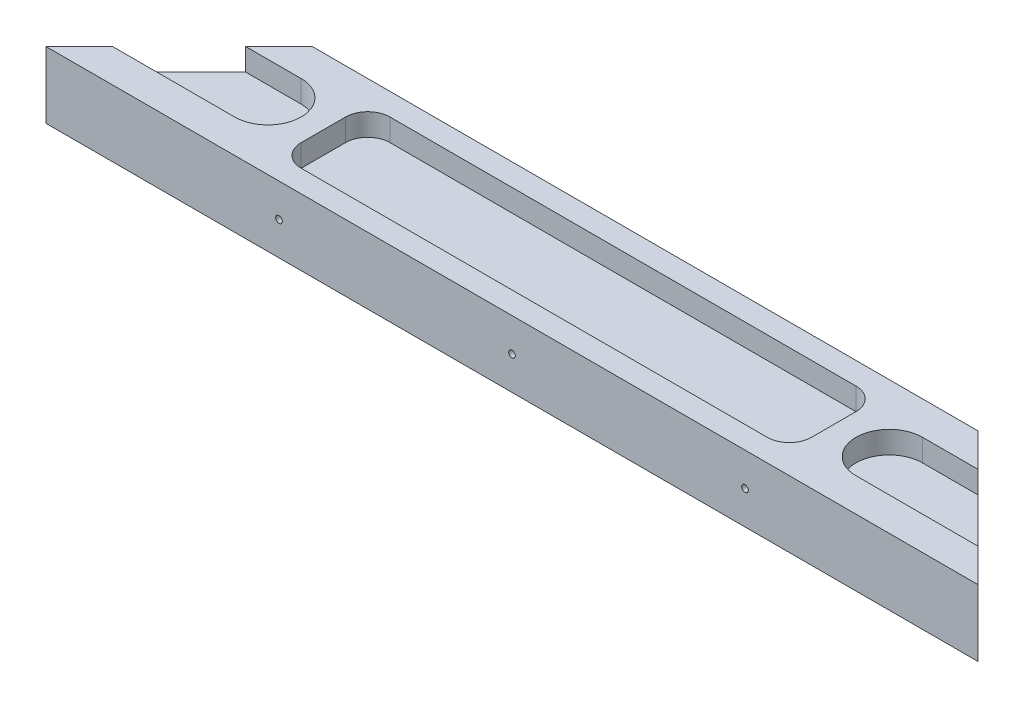
ISO-10303-21;
HEADER;
FILE_DESCRIPTION(('STEP AP214'),'2;1');
FILE_NAME('part.step','',(''),(''),'','','');
FILE_SCHEMA(('AUTOMOTIVE_DESIGN { 1 0 10303 214 1 1 1 1 }'));
ENDSEC;
DATA;
#1=APPLICATION_CONTEXT('core data for automotive mechanical design processes');
#2=APPLICATION_PROTOCOL_DEFINITION('international standard','automotive_design',2000,#1);
#3=PRODUCT_CONTEXT('',#1,'mechanical');
#4=PRODUCT('Part','Part','',(#3));
#5=PRODUCT_RELATED_PRODUCT_CATEGORY('part','',(#4));
#6=PRODUCT_DEFINITION_FORMATION('','',#4);
#7=PRODUCT_DEFINITION_CONTEXT('part definition',#1,'design');
#8=PRODUCT_DEFINITION('design','',#6,#7);
#9=PRODUCT_DEFINITION_SHAPE('','',#8);
#10=(LENGTH_UNIT() NAMED_UNIT(*) SI_UNIT(.MILLI.,.METRE.));
#11=(NAMED_UNIT(*) PLANE_ANGLE_UNIT() SI_UNIT($,.RADIAN.));
#12=(NAMED_UNIT(*) SI_UNIT($,.STERADIAN.) SOLID_ANGLE_UNIT());
#13=UNCERTAINTY_MEASURE_WITH_UNIT(LENGTH_MEASURE(1.E-05),#10,'distance_accuracy_value','');
#14=(GEOMETRIC_REPRESENTATION_CONTEXT(3) GLOBAL_UNCERTAINTY_ASSIGNED_CONTEXT((#13)) GLOBAL_UNIT_ASSIGNED_CONTEXT((#10,
#11,#12)) REPRESENTATION_CONTEXT('',''));
#15=CARTESIAN_POINT('',(0.,0.,0.));
#16=DIRECTION('',(0.,0.,1.));
#17=DIRECTION('',(1.,0.,0.));
#18=AXIS2_PLACEMENT_3D('',#15,#16,#17);
#19=CARTESIAN_POINT('',(30.,15.,-30.));
#20=DIRECTION('',(0.707106781186547,0.,0.707106781186548));
#21=DIRECTION('',(0.707106781186548,0.,-0.707106781186547));
#22=AXIS2_PLACEMENT_3D('',#19,#20,#21);
#23=PLANE('',#22);
#24=DIRECTION('',(-0.707106781186548,0.,0.707106781186547));
#25=VECTOR('',#24,1.);
#26=CARTESIAN_POINT('',(30.,10.,-30.));
#27=LINE('',#26,#25);
#28=CARTESIAN_POINT('',(22.5,10.,-22.5));
#29=VERTEX_POINT('',#28);
#30=CARTESIAN_POINT('',(7.5,10.,-7.49999999999999));
#31=VERTEX_POINT('',#30);
#32=EDGE_CURVE('E11',#29,#31,#27,.T.);
#33=ORIENTED_EDGE('',*,*,#32,.F.);
#34=DIRECTION('',(0.,1.,0.));
#35=VECTOR('',#34,1.);
#36=CARTESIAN_POINT('',(22.5,15.,-22.5));
#37=LINE('',#36,#35);
#38=CARTESIAN_POINT('',(22.5,15.,-22.5));
#39=VERTEX_POINT('',#38);
#40=EDGE_CURVE('E306',#29,#39,#37,.T.);
#41=ORIENTED_EDGE('',*,*,#40,.T.);
#42=DIRECTION('',(-0.707106781186548,0.,0.707106781186547));
#43=VECTOR('',#42,1.);
#44=CARTESIAN_POINT('',(30.,15.,-30.));
#45=LINE('',#44,#43);
#46=CARTESIAN_POINT('',(30.,15.,-30.));
#47=VERTEX_POINT('',#46);
#48=EDGE_CURVE('E310',#47,#39,#45,.T.);
#49=ORIENTED_EDGE('',*,*,#48,.F.);
#50=DIRECTION('',(0.,-1.,0.));
#51=VECTOR('',#50,1.);
#52=CARTESIAN_POINT('',(30.,15.,-30.));
#53=LINE('',#52,#51);
#54=CARTESIAN_POINT('',(30.,0.,-30.));
#55=VERTEX_POINT('',#54);
#56=EDGE_CURVE('E322',#47,#55,#53,.T.);
#57=ORIENTED_EDGE('',*,*,#56,.T.);
#58=DIRECTION('',(-0.707106781186548,0.,0.707106781186547));
#59=VECTOR('',#58,1.);
#60=CARTESIAN_POINT('',(30.,0.,-30.));
#61=LINE('',#60,#59);
#62=CARTESIAN_POINT('',(0.,0.,0.));
#63=VERTEX_POINT('',#62);
#64=EDGE_CURVE('E309',#55,#63,#61,.T.);
#65=ORIENTED_EDGE('',*,*,#64,.T.);
#66=DIRECTION('',(0.,-1.,0.));
#67=VECTOR('',#66,1.);
#68=CARTESIAN_POINT('',(0.,15.,0.));
#69=LINE('',#68,#67);
#70=CARTESIAN_POINT('',(0.,15.,0.));
#71=VERTEX_POINT('',#70);
#72=EDGE_CURVE('E339',#71,#63,#69,.T.);
#73=ORIENTED_EDGE('',*,*,#72,.F.);
#74=CARTESIAN_POINT('',(7.5,15.,-7.5));
#75=VERTEX_POINT('',#74);
#76=EDGE_CURVE('E314',#75,#71,#45,.T.);
#77=ORIENTED_EDGE('',*,*,#76,.F.);
#78=DIRECTION('',(0.,-1.,0.));
#79=VECTOR('',#78,1.);
#80=CARTESIAN_POINT('',(7.5,15.,-7.5));
#81=LINE('',#80,#79);
#82=EDGE_CURVE('E303',#75,#31,#81,.T.);
#83=ORIENTED_EDGE('',*,*,#82,.T.);
#84=EDGE_LOOP('',(#33,#41,#49,#57,#65,#73,#77,#83));
#85=FACE_BOUND('',#84,.T.);
#86=ADVANCED_FACE('F39',(#85),#23,.F.);
#87=CARTESIAN_POINT('',(0.,15.,0.));
#88=DIRECTION('',(0.,0.,-1.));
#89=DIRECTION('',(-1.,0.,0.));
#90=AXIS2_PLACEMENT_3D('',#87,#88,#89);
#91=PLANE('',#90);
#92=CARTESIAN_POINT('',(157.5,7.5,0.));
#93=DIRECTION('',(0.,0.,1.));
#94=DIRECTION('',(1.,0.,0.));
#95=AXIS2_PLACEMENT_3D('',#92,#93,#94);
#96=CIRCLE('',#95,0.750000000000012);
#97=CARTESIAN_POINT('',(158.25,7.5,0.));
#98=VERTEX_POINT('',#97);
#99=EDGE_CURVE('E250',#98,#98,#96,.T.);
#100=ORIENTED_EDGE('',*,*,#99,.F.);
#101=EDGE_LOOP('',(#100));
#102=FACE_BOUND('',#101,.T.);
#103=CARTESIAN_POINT('',(52.5,7.5,0.));
#104=DIRECTION('',(0.,0.,1.));
#105=DIRECTION('',(1.,0.,0.));
#106=AXIS2_PLACEMENT_3D('',#103,#104,#105);
#107=CIRCLE('',#106,0.749999999999999);
#108=CARTESIAN_POINT('',(53.25,7.5,0.));
#109=VERTEX_POINT('',#108);
#110=EDGE_CURVE('E249',#109,#109,#107,.T.);
#111=ORIENTED_EDGE('',*,*,#110,.F.);
#112=EDGE_LOOP('',(#111));
#113=FACE_BOUND('',#112,.T.);
#114=CARTESIAN_POINT('',(105.,7.5,0.));
#115=DIRECTION('',(0.,0.,1.));
#116=DIRECTION('',(1.,0.,0.));
#117=AXIS2_PLACEMENT_3D('',#114,#115,#116);
#118=CIRCLE('',#117,0.749999999999999);
#119=CARTESIAN_POINT('',(105.75,7.5,0.));
#120=VERTEX_POINT('',#119);
#121=EDGE_CURVE('E253',#120,#120,#118,.T.);
#122=ORIENTED_EDGE('',*,*,#121,.F.);
#123=EDGE_LOOP('',(#122));
#124=FACE_BOUND('',#123,.T.);
#125=DIRECTION('',(1.,0.,0.));
#126=VECTOR('',#125,1.);
#127=CARTESIAN_POINT('',(0.,0.,0.));
#128=LINE('',#127,#126);
#129=CARTESIAN_POINT('',(210.,0.,0.));
#130=VERTEX_POINT('',#129);
#131=EDGE_CURVE('E325',#63,#130,#128,.T.);
#132=ORIENTED_EDGE('',*,*,#131,.T.);
#133=DIRECTION('',(0.,-1.,0.));
#134=VECTOR('',#133,1.);
#135=CARTESIAN_POINT('',(210.,15.,0.));
#136=LINE('',#135,#134);
#137=CARTESIAN_POINT('',(210.,15.,0.));
#138=VERTEX_POINT('',#137);
#139=EDGE_CURVE('E336',#138,#130,#136,.T.);
#140=ORIENTED_EDGE('',*,*,#139,.F.);
#141=DIRECTION('',(1.,0.,0.));
#142=VECTOR('',#141,1.);
#143=CARTESIAN_POINT('',(0.,15.,0.));
#144=LINE('',#143,#142);
#145=EDGE_CURVE('E313',#71,#138,#144,.T.);
#146=ORIENTED_EDGE('',*,*,#145,.F.);
#147=ORIENTED_EDGE('',*,*,#72,.T.);
#148=EDGE_LOOP('',(#132,#140,#146,#147));
#149=FACE_BOUND('',#148,.T.);
#150=ADVANCED_FACE('F395',(#102,#113,#124,#149),#91,.F.);
#151=CARTESIAN_POINT('',(210.,15.,0.));
#152=DIRECTION('',(-0.707106781186547,0.,0.707106781186548));
#153=DIRECTION('',(0.707106781186548,0.,0.707106781186547));
#154=AXIS2_PLACEMENT_3D('',#151,#152,#153);
#155=PLANE('',#154);
#156=DIRECTION('',(0.707106781186548,0.,0.707106781186547));
#157=VECTOR('',#156,1.);
#158=CARTESIAN_POINT('',(210.,10.,0.));
#159=LINE('',#158,#157);
#160=CARTESIAN_POINT('',(187.5,10.,-22.5));
#161=VERTEX_POINT('',#160);
#162=CARTESIAN_POINT('',(202.5,10.,-7.5));
#163=VERTEX_POINT('',#162);
#164=EDGE_CURVE('E46',#161,#163,#159,.T.);
#165=ORIENTED_EDGE('',*,*,#164,.T.);
#166=DIRECTION('',(0.,1.,0.));
#167=VECTOR('',#166,1.);
#168=CARTESIAN_POINT('',(202.5,15.,-7.49999999999999));
#169=LINE('',#168,#167);
#170=CARTESIAN_POINT('',(202.5,15.,-7.5));
#171=VERTEX_POINT('',#170);
#172=EDGE_CURVE('E300',#163,#171,#169,.T.);
#173=ORIENTED_EDGE('',*,*,#172,.T.);
#174=DIRECTION('',(-0.707106781186548,0.,-0.707106781186547));
#175=VECTOR('',#174,1.);
#176=CARTESIAN_POINT('',(210.,15.,0.));
#177=LINE('',#176,#175);
#178=EDGE_CURVE('E317',#138,#171,#177,.T.);
#179=ORIENTED_EDGE('',*,*,#178,.F.);
#180=ORIENTED_EDGE('',*,*,#139,.T.);
#181=DIRECTION('',(-0.707106781186548,0.,-0.707106781186547));
#182=VECTOR('',#181,1.);
#183=CARTESIAN_POINT('',(210.,0.,0.));
#184=LINE('',#183,#182);
#185=CARTESIAN_POINT('',(180.,0.,-30.));
#186=VERTEX_POINT('',#185);
#187=EDGE_CURVE('E327',#130,#186,#184,.T.);
#188=ORIENTED_EDGE('',*,*,#187,.T.);
#189=DIRECTION('',(0.,-1.,0.));
#190=VECTOR('',#189,1.);
#191=CARTESIAN_POINT('',(180.,15.,-30.));
#192=LINE('',#191,#190);
#193=CARTESIAN_POINT('',(180.,15.,-30.));
#194=VERTEX_POINT('',#193);
#195=EDGE_CURVE('E333',#194,#186,#192,.T.);
#196=ORIENTED_EDGE('',*,*,#195,.F.);
#197=CARTESIAN_POINT('',(187.5,15.,-22.5));
#198=VERTEX_POINT('',#197);
#199=EDGE_CURVE('E316',#198,#194,#177,.T.);
#200=ORIENTED_EDGE('',*,*,#199,.F.);
#201=DIRECTION('',(0.,-1.,0.));
#202=VECTOR('',#201,1.);
#203=CARTESIAN_POINT('',(187.5,15.,-22.5));
#204=LINE('',#203,#202);
#205=EDGE_CURVE('E61',#198,#161,#204,.T.);
#206=ORIENTED_EDGE('',*,*,#205,.T.);
#207=EDGE_LOOP('',(#165,#173,#179,#180,#188,#196,#200,#206));
#208=FACE_BOUND('',#207,.T.);
#209=ADVANCED_FACE('F348',(#208),#155,.F.);
#210=CARTESIAN_POINT('',(180.,15.,-30.));
#211=DIRECTION('',(0.,0.,1.));
#212=DIRECTION('',(1.,0.,0.));
#213=AXIS2_PLACEMENT_3D('',#210,#211,#212);
#214=PLANE('',#213);
#215=CARTESIAN_POINT('',(157.5,7.5,-30.));
#216=DIRECTION('',(0.,0.,1.));
#217=DIRECTION('',(1.,0.,0.));
#218=AXIS2_PLACEMENT_3D('',#215,#216,#217);
#219=CIRCLE('',#218,0.750000000000012);
#220=CARTESIAN_POINT('',(158.25,7.5,-30.));
#221=VERTEX_POINT('',#220);
#222=EDGE_CURVE('E234',#221,#221,#219,.F.);
#223=ORIENTED_EDGE('',*,*,#222,.F.);
#224=EDGE_LOOP('',(#223));
#225=FACE_BOUND('',#224,.T.);
#226=CARTESIAN_POINT('',(52.5,7.5,-30.));
#227=DIRECTION('',(0.,0.,1.));
#228=DIRECTION('',(1.,0.,0.));
#229=AXIS2_PLACEMENT_3D('',#226,#227,#228);
#230=CIRCLE('',#229,0.749999999999999);
#231=CARTESIAN_POINT('',(53.25,7.5,-30.));
#232=VERTEX_POINT('',#231);
#233=EDGE_CURVE('E246',#232,#232,#230,.F.);
#234=ORIENTED_EDGE('',*,*,#233,.F.);
#235=EDGE_LOOP('',(#234));
#236=FACE_BOUND('',#235,.T.);
#237=CARTESIAN_POINT('',(105.,7.5,-30.));
#238=DIRECTION('',(0.,0.,1.));
#239=DIRECTION('',(1.,0.,0.));
#240=AXIS2_PLACEMENT_3D('',#237,#238,#239);
#241=CIRCLE('',#240,0.749999999999999);
#242=CARTESIAN_POINT('',(105.75,7.5,-30.));
#243=VERTEX_POINT('',#242);
#244=EDGE_CURVE('E260',#243,#243,#241,.F.);
#245=ORIENTED_EDGE('',*,*,#244,.F.);
#246=EDGE_LOOP('',(#245));
#247=FACE_BOUND('',#246,.T.);
#248=DIRECTION('',(-1.,0.,0.));
#249=VECTOR('',#248,1.);
#250=CARTESIAN_POINT('',(180.,0.,-30.));
#251=LINE('',#250,#249);
#252=EDGE_CURVE('E329',#186,#55,#251,.T.);
#253=ORIENTED_EDGE('',*,*,#252,.T.);
#254=ORIENTED_EDGE('',*,*,#56,.F.);
#255=DIRECTION('',(-1.,0.,0.));
#256=VECTOR('',#255,1.);
#257=CARTESIAN_POINT('',(180.,15.,-30.));
#258=LINE('',#257,#256);
#259=EDGE_CURVE('E320',#194,#47,#258,.T.);
#260=ORIENTED_EDGE('',*,*,#259,.F.);
#261=ORIENTED_EDGE('',*,*,#195,.T.);
#262=EDGE_LOOP('',(#253,#254,#260,#261));
#263=FACE_BOUND('',#262,.T.);
#264=ADVANCED_FACE('F376',(#225,#236,#247,#263),#214,.F.);
#265=CARTESIAN_POINT('',(0.,15.,0.));
#266=DIRECTION('',(0.,-1.,0.));
#267=DIRECTION('',(0.,0.,-1.));
#268=AXIS2_PLACEMENT_3D('',#265,#266,#267);
#269=PLANE('',#268);
#270=DIRECTION('',(-1.,0.,0.));
#271=VECTOR('',#270,1.);
#272=CARTESIAN_POINT('',(52.5,15.,-25.));
#273=LINE('',#272,#271);
#274=CARTESIAN_POINT('',(157.5,15.,-25.));
#275=VERTEX_POINT('',#274);
#276=CARTESIAN_POINT('',(52.5,15.,-25.));
#277=VERTEX_POINT('',#276);
#278=EDGE_CURVE('E216',#275,#277,#273,.T.);
#279=ORIENTED_EDGE('',*,*,#278,.F.);
#280=CARTESIAN_POINT('',(157.5,15.,-20.));
#281=DIRECTION('',(0.,1.,0.));
#282=DIRECTION('',(0.,0.,-1.));
#283=AXIS2_PLACEMENT_3D('',#280,#281,#282);
#284=CIRCLE('',#283,5.);
#285=CARTESIAN_POINT('',(162.5,15.,-19.9999999999999));
#286=VERTEX_POINT('',#285);
#287=EDGE_CURVE('E53',#286,#275,#284,.T.);
#288=ORIENTED_EDGE('',*,*,#287,.F.);
#289=DIRECTION('',(0.,0.,-1.));
#290=VECTOR('',#289,1.);
#291=CARTESIAN_POINT('',(162.5,15.,-19.9999999999999));
#292=LINE('',#291,#290);
#293=CARTESIAN_POINT('',(162.5,15.,-10.));
#294=VERTEX_POINT('',#293);
#295=EDGE_CURVE('E196',#294,#286,#292,.T.);
#296=ORIENTED_EDGE('',*,*,#295,.F.);
#297=CARTESIAN_POINT('',(157.5,15.,-10.));
#298=DIRECTION('',(0.,1.,0.));
#299=DIRECTION('',(0.,0.,1.));
#300=AXIS2_PLACEMENT_3D('',#297,#298,#299);
#301=CIRCLE('',#300,5.);
#302=CARTESIAN_POINT('',(157.5,15.,-5.));
#303=VERTEX_POINT('',#302);
#304=EDGE_CURVE('E199',#303,#294,#301,.T.);
#305=ORIENTED_EDGE('',*,*,#304,.F.);
#306=DIRECTION('',(1.,0.,0.));
#307=VECTOR('',#306,1.);
#308=CARTESIAN_POINT('',(52.5,15.,-5.));
#309=LINE('',#308,#307);
#310=CARTESIAN_POINT('',(52.5,15.,-5.));
#311=VERTEX_POINT('',#310);
#312=EDGE_CURVE('E227',#311,#303,#309,.T.);
#313=ORIENTED_EDGE('',*,*,#312,.F.);
#314=CARTESIAN_POINT('',(52.5,15.,-10.));
#315=DIRECTION('',(0.,1.,0.));
#316=DIRECTION('',(0.,0.,1.));
#317=AXIS2_PLACEMENT_3D('',#314,#315,#316);
#318=CIRCLE('',#317,5.);
#319=CARTESIAN_POINT('',(47.5,15.,-10.));
#320=VERTEX_POINT('',#319);
#321=EDGE_CURVE('E224',#320,#311,#318,.T.);
#322=ORIENTED_EDGE('',*,*,#321,.F.);
#323=DIRECTION('',(0.,0.,1.));
#324=VECTOR('',#323,1.);
#325=CARTESIAN_POINT('',(47.5,15.,-19.9999999999999));
#326=LINE('',#325,#324);
#327=CARTESIAN_POINT('',(47.5,15.,-19.9999999999999));
#328=VERTEX_POINT('',#327);
#329=EDGE_CURVE('E221',#328,#320,#326,.T.);
#330=ORIENTED_EDGE('',*,*,#329,.F.);
#331=CARTESIAN_POINT('',(52.5,15.,-20.));
#332=DIRECTION('',(0.,1.,0.));
#333=DIRECTION('',(0.,0.,1.));
#334=AXIS2_PLACEMENT_3D('',#331,#332,#333);
#335=CIRCLE('',#334,5.);
#336=EDGE_CURVE('E218',#277,#328,#335,.T.);
#337=ORIENTED_EDGE('',*,*,#336,.F.);
#338=EDGE_LOOP('',(#279,#288,#296,#305,#313,#322,#330,#337));
#339=FACE_BOUND('',#338,.T.);
#340=ORIENTED_EDGE('',*,*,#48,.T.);
#341=DIRECTION('',(-1.,0.,0.));
#342=VECTOR('',#341,1.);
#343=CARTESIAN_POINT('',(-5.,15.,-22.5));
#344=LINE('',#343,#342);
#345=CARTESIAN_POINT('',(35.,15.,-22.5));
#346=VERTEX_POINT('',#345);
#347=EDGE_CURVE('E267',#346,#39,#344,.T.);
#348=ORIENTED_EDGE('',*,*,#347,.F.);
#349=CARTESIAN_POINT('',(35.,15.,-15.));
#350=DIRECTION('',(0.,1.,0.));
#351=DIRECTION('',(0.,0.,1.));
#352=AXIS2_PLACEMENT_3D('',#349,#350,#351);
#353=CIRCLE('',#352,7.5);
#354=CARTESIAN_POINT('',(35.,15.,-7.5));
#355=VERTEX_POINT('',#354);
#356=EDGE_CURVE('E274',#355,#346,#353,.T.);
#357=ORIENTED_EDGE('',*,*,#356,.F.);
#358=DIRECTION('',(-1.,0.,0.));
#359=VECTOR('',#358,1.);
#360=CARTESIAN_POINT('',(0.,15.,-7.49999999999999));
#361=LINE('',#360,#359);
#362=EDGE_CURVE('E344',#355,#75,#361,.T.);
#363=ORIENTED_EDGE('',*,*,#362,.T.);
#364=ORIENTED_EDGE('',*,*,#76,.T.);
#365=ORIENTED_EDGE('',*,*,#145,.T.);
#366=ORIENTED_EDGE('',*,*,#178,.T.);
#367=DIRECTION('',(1.,0.,0.));
#368=VECTOR('',#367,1.);
#369=CARTESIAN_POINT('',(215.,15.,-7.49999999999999));
#370=LINE('',#369,#368);
#371=CARTESIAN_POINT('',(175.,15.,-7.5));
#372=VERTEX_POINT('',#371);
#373=EDGE_CURVE('E288',#372,#171,#370,.T.);
#374=ORIENTED_EDGE('',*,*,#373,.F.);
#375=CARTESIAN_POINT('',(175.,15.,-15.));
#376=DIRECTION('',(0.,1.,0.));
#377=DIRECTION('',(0.,0.,-1.));
#378=AXIS2_PLACEMENT_3D('',#375,#376,#377);
#379=CIRCLE('',#378,7.5);
#380=CARTESIAN_POINT('',(175.,15.,-22.5));
#381=VERTEX_POINT('',#380);
#382=EDGE_CURVE('E277',#381,#372,#379,.T.);
#383=ORIENTED_EDGE('',*,*,#382,.F.);
#384=DIRECTION('',(1.,0.,0.));
#385=VECTOR('',#384,1.);
#386=CARTESIAN_POINT('',(0.,15.,-22.5));
#387=LINE('',#386,#385);
#388=EDGE_CURVE('E342',#381,#198,#387,.T.);
#389=ORIENTED_EDGE('',*,*,#388,.T.);
#390=ORIENTED_EDGE('',*,*,#199,.T.);
#391=ORIENTED_EDGE('',*,*,#259,.T.);
#392=EDGE_LOOP('',(#340,#348,#357,#363,#364,#365,#366,#374,#383,#389,#390,#391));
#393=FACE_BOUND('',#392,.T.);
#394=ADVANCED_FACE('F364',(#339,#393),#269,.F.);
#395=CARTESIAN_POINT('',(0.,0.,0.));
#396=DIRECTION('',(0.,-1.,0.));
#397=DIRECTION('',(0.,0.,-1.));
#398=AXIS2_PLACEMENT_3D('',#395,#396,#397);
#399=PLANE('',#398);
#400=ORIENTED_EDGE('',*,*,#64,.F.);
#401=ORIENTED_EDGE('',*,*,#252,.F.);
#402=ORIENTED_EDGE('',*,*,#187,.F.);
#403=ORIENTED_EDGE('',*,*,#131,.F.);
#404=EDGE_LOOP('',(#400,#401,#402,#403));
#405=FACE_BOUND('',#404,.T.);
#406=ADVANCED_FACE('F373',(#405),#399,.T.);
#407=CARTESIAN_POINT('',(215.,10.,-15.));
#408=DIRECTION('',(0.,-1.,0.));
#409=DIRECTION('',(0.,0.,-1.));
#410=AXIS2_PLACEMENT_3D('',#407,#408,#409);
#411=PLANE('',#410);
#412=DIRECTION('',(-1.,0.,0.));
#413=VECTOR('',#412,1.);
#414=CARTESIAN_POINT('',(215.,10.,-22.5));
#415=LINE('',#414,#413);
#416=CARTESIAN_POINT('',(175.,10.,-22.5));
#417=VERTEX_POINT('',#416);
#418=EDGE_CURVE('E290',#161,#417,#415,.T.);
#419=ORIENTED_EDGE('',*,*,#418,.T.);
#420=CARTESIAN_POINT('',(175.,10.,-15.));
#421=DIRECTION('',(0.,1.,0.));
#422=DIRECTION('',(0.,0.,-1.));
#423=AXIS2_PLACEMENT_3D('',#420,#421,#422);
#424=CIRCLE('',#423,7.5);
#425=CARTESIAN_POINT('',(175.,10.,-7.5));
#426=VERTEX_POINT('',#425);
#427=EDGE_CURVE('E295',#417,#426,#424,.T.);
#428=ORIENTED_EDGE('',*,*,#427,.T.);
#429=DIRECTION('',(1.,0.,0.));
#430=VECTOR('',#429,1.);
#431=CARTESIAN_POINT('',(215.,10.,-7.49999999999999));
#432=LINE('',#431,#430);
#433=EDGE_CURVE('E286',#426,#163,#432,.T.);
#434=ORIENTED_EDGE('',*,*,#433,.T.);
#435=ORIENTED_EDGE('',*,*,#164,.F.);
#436=EDGE_LOOP('',(#419,#428,#434,#435));
#437=FACE_BOUND('',#436,.T.);
#438=ADVANCED_FACE('F352',(#437),#411,.F.);
#439=CARTESIAN_POINT('',(215.,10.,-7.49999999999999));
#440=DIRECTION('',(0.,0.,1.));
#441=DIRECTION('',(1.,0.,0.));
#442=AXIS2_PLACEMENT_3D('',#439,#440,#441);
#443=PLANE('',#442);
#444=ORIENTED_EDGE('',*,*,#433,.F.);
#445=DIRECTION('',(0.,1.,0.));
#446=VECTOR('',#445,1.);
#447=CARTESIAN_POINT('',(175.,10.,-7.5));
#448=LINE('',#447,#446);
#449=EDGE_CURVE('E263',#426,#372,#448,.T.);
#450=ORIENTED_EDGE('',*,*,#449,.T.);
#451=ORIENTED_EDGE('',*,*,#373,.T.);
#452=ORIENTED_EDGE('',*,*,#172,.F.);
#453=EDGE_LOOP('',(#444,#450,#451,#452));
#454=FACE_BOUND('',#453,.T.);
#455=ADVANCED_FACE('F361',(#454),#443,.F.);
#456=CARTESIAN_POINT('',(215.,10.,-22.5));
#457=DIRECTION('',(0.,0.,-1.));
#458=DIRECTION('',(-1.,0.,0.));
#459=AXIS2_PLACEMENT_3D('',#456,#457,#458);
#460=PLANE('',#459);
#461=ORIENTED_EDGE('',*,*,#388,.F.);
#462=DIRECTION('',(0.,1.,0.));
#463=VECTOR('',#462,1.);
#464=CARTESIAN_POINT('',(175.,10.,-22.5));
#465=LINE('',#464,#463);
#466=EDGE_CURVE('E283',#417,#381,#465,.T.);
#467=ORIENTED_EDGE('',*,*,#466,.F.);
#468=ORIENTED_EDGE('',*,*,#418,.F.);
#469=ORIENTED_EDGE('',*,*,#205,.F.);
#470=EDGE_LOOP('',(#461,#467,#468,#469));
#471=FACE_BOUND('',#470,.T.);
#472=ADVANCED_FACE('F355',(#471),#460,.F.);
#473=CARTESIAN_POINT('',(175.,10.,-15.));
#474=DIRECTION('',(0.,1.,0.));
#475=DIRECTION('',(0.,0.,1.));
#476=AXIS2_PLACEMENT_3D('',#473,#474,#475);
#477=CYLINDRICAL_SURFACE('',#476,7.5);
#478=ORIENTED_EDGE('',*,*,#382,.T.);
#479=ORIENTED_EDGE('',*,*,#449,.F.);
#480=ORIENTED_EDGE('',*,*,#427,.F.);
#481=ORIENTED_EDGE('',*,*,#466,.T.);
#482=EDGE_LOOP('',(#478,#479,#480,#481));
#483=FACE_BOUND('',#482,.T.);
#484=ADVANCED_FACE('F359',(#483),#477,.F.);
#485=CARTESIAN_POINT('',(-5.,10.,-15.));
#486=DIRECTION('',(0.,1.,0.));
#487=DIRECTION('',(0.,0.,1.));
#488=AXIS2_PLACEMENT_3D('',#485,#486,#487);
#489=PLANE('',#488);
#490=ORIENTED_EDGE('',*,*,#32,.T.);
#491=DIRECTION('',(1.,0.,0.));
#492=VECTOR('',#491,1.);
#493=CARTESIAN_POINT('',(-5.,10.,-7.49999999999999));
#494=LINE('',#493,#492);
#495=CARTESIAN_POINT('',(35.,10.,-7.5));
#496=VERTEX_POINT('',#495);
#497=EDGE_CURVE('E264',#31,#496,#494,.T.);
#498=ORIENTED_EDGE('',*,*,#497,.T.);
#499=CARTESIAN_POINT('',(35.,10.,-15.));
#500=DIRECTION('',(0.,1.,0.));
#501=DIRECTION('',(0.,0.,1.));
#502=AXIS2_PLACEMENT_3D('',#499,#500,#501);
#503=CIRCLE('',#502,7.5);
#504=CARTESIAN_POINT('',(35.,10.,-22.5));
#505=VERTEX_POINT('',#504);
#506=EDGE_CURVE('E266',#496,#505,#503,.T.);
#507=ORIENTED_EDGE('',*,*,#506,.T.);
#508=DIRECTION('',(-1.,0.,0.));
#509=VECTOR('',#508,1.);
#510=CARTESIAN_POINT('',(-5.,10.,-22.5));
#511=LINE('',#510,#509);
#512=EDGE_CURVE('E270',#505,#29,#511,.T.);
#513=ORIENTED_EDGE('',*,*,#512,.T.);
#514=EDGE_LOOP('',(#490,#498,#507,#513));
#515=FACE_BOUND('',#514,.T.);
#516=ADVANCED_FACE('F421',(#515),#489,.T.);
#517=CARTESIAN_POINT('',(-5.,10.,-22.5));
#518=DIRECTION('',(0.,0.,-1.));
#519=DIRECTION('',(-1.,0.,0.));
#520=AXIS2_PLACEMENT_3D('',#517,#518,#519);
#521=PLANE('',#520);
#522=ORIENTED_EDGE('',*,*,#512,.F.);
#523=DIRECTION('',(0.,1.,0.));
#524=VECTOR('',#523,1.);
#525=CARTESIAN_POINT('',(35.,10.,-22.5));
#526=LINE('',#525,#524);
#527=EDGE_CURVE('E279',#505,#346,#526,.T.);
#528=ORIENTED_EDGE('',*,*,#527,.T.);
#529=ORIENTED_EDGE('',*,*,#347,.T.);
#530=ORIENTED_EDGE('',*,*,#40,.F.);
#531=EDGE_LOOP('',(#522,#528,#529,#530));
#532=FACE_BOUND('',#531,.T.);
#533=ADVANCED_FACE('F386',(#532),#521,.F.);
#534=CARTESIAN_POINT('',(-5.,10.,-7.49999999999999));
#535=DIRECTION('',(0.,0.,1.));
#536=DIRECTION('',(1.,0.,0.));
#537=AXIS2_PLACEMENT_3D('',#534,#535,#536);
#538=PLANE('',#537);
#539=ORIENTED_EDGE('',*,*,#362,.F.);
#540=DIRECTION('',(0.,1.,0.));
#541=VECTOR('',#540,1.);
#542=CARTESIAN_POINT('',(35.,10.,-7.5));
#543=LINE('',#542,#541);
#544=EDGE_CURVE('E273',#496,#355,#543,.T.);
#545=ORIENTED_EDGE('',*,*,#544,.F.);
#546=ORIENTED_EDGE('',*,*,#497,.F.);
#547=ORIENTED_EDGE('',*,*,#82,.F.);
#548=EDGE_LOOP('',(#539,#545,#546,#547));
#549=FACE_BOUND('',#548,.T.);
#550=ADVANCED_FACE('F393',(#549),#538,.F.);
#551=CARTESIAN_POINT('',(35.,10.,-15.));
#552=DIRECTION('',(0.,1.,0.));
#553=DIRECTION('',(0.,0.,1.));
#554=AXIS2_PLACEMENT_3D('',#551,#552,#553);
#555=CYLINDRICAL_SURFACE('',#554,7.5);
#556=ORIENTED_EDGE('',*,*,#356,.T.);
#557=ORIENTED_EDGE('',*,*,#527,.F.);
#558=ORIENTED_EDGE('',*,*,#506,.F.);
#559=ORIENTED_EDGE('',*,*,#544,.T.);
#560=EDGE_LOOP('',(#556,#557,#558,#559));
#561=FACE_BOUND('',#560,.T.);
#562=ADVANCED_FACE('F389',(#561),#555,.F.);
#563=CARTESIAN_POINT('',(105.,7.5,-32.1213203435596));
#564=DIRECTION('',(0.,0.,1.));
#565=DIRECTION('',(1.,0.,0.));
#566=AXIS2_PLACEMENT_3D('',#563,#564,#565);
#567=CYLINDRICAL_SURFACE('',#566,0.749999999999999);
#568=ORIENTED_EDGE('',*,*,#244,.T.);
#569=EDGE_LOOP('',(#568));
#570=FACE_BOUND('',#569,.T.);
#571=ORIENTED_EDGE('',*,*,#121,.T.);
#572=EDGE_LOOP('',(#571));
#573=FACE_BOUND('',#572,.T.);
#574=ADVANCED_FACE('F427',(#570,#573),#567,.F.);
#575=CARTESIAN_POINT('',(52.5,7.5,-32.1213203435596));
#576=DIRECTION('',(0.,0.,1.));
#577=DIRECTION('',(1.,0.,0.));
#578=AXIS2_PLACEMENT_3D('',#575,#576,#577);
#579=CYLINDRICAL_SURFACE('',#578,0.749999999999999);
#580=ORIENTED_EDGE('',*,*,#233,.T.);
#581=EDGE_LOOP('',(#580));
#582=FACE_BOUND('',#581,.T.);
#583=ORIENTED_EDGE('',*,*,#110,.T.);
#584=EDGE_LOOP('',(#583));
#585=FACE_BOUND('',#584,.T.);
#586=ADVANCED_FACE('F435',(#582,#585),#579,.F.);
#587=CARTESIAN_POINT('',(157.5,7.5,-32.1213203435596));
#588=DIRECTION('',(0.,0.,1.));
#589=DIRECTION('',(1.,0.,0.));
#590=AXIS2_PLACEMENT_3D('',#587,#588,#589);
#591=CYLINDRICAL_SURFACE('',#590,0.750000000000012);
#592=ORIENTED_EDGE('',*,*,#222,.T.);
#593=EDGE_LOOP('',(#592));
#594=FACE_BOUND('',#593,.T.);
#595=ORIENTED_EDGE('',*,*,#99,.T.);
#596=EDGE_LOOP('',(#595));
#597=FACE_BOUND('',#596,.T.);
#598=ADVANCED_FACE('F437',(#594,#597),#591,.F.);
#599=CARTESIAN_POINT('',(157.5,10.,-20.));
#600=DIRECTION('',(0.,1.,0.));
#601=DIRECTION('',(0.,0.,1.));
#602=AXIS2_PLACEMENT_3D('',#599,#600,#601);
#603=CYLINDRICAL_SURFACE('',#602,5.);
#604=ORIENTED_EDGE('',*,*,#287,.T.);
#605=DIRECTION('',(0.,1.,0.));
#606=VECTOR('',#605,1.);
#607=CARTESIAN_POINT('',(157.5,10.,-25.));
#608=LINE('',#607,#606);
#609=CARTESIAN_POINT('',(157.5,10.,-25.));
#610=VERTEX_POINT('',#609);
#611=EDGE_CURVE('E173',#610,#275,#608,.T.);
#612=ORIENTED_EDGE('',*,*,#611,.F.);
#613=CARTESIAN_POINT('',(157.5,10.,-20.));
#614=DIRECTION('',(0.,1.,0.));
#615=DIRECTION('',(0.,0.,-1.));
#616=AXIS2_PLACEMENT_3D('',#613,#614,#615);
#617=CIRCLE('',#616,5.);
#618=CARTESIAN_POINT('',(162.5,10.,-19.9999999999999));
#619=VERTEX_POINT('',#618);
#620=EDGE_CURVE('E177',#619,#610,#617,.T.);
#621=ORIENTED_EDGE('',*,*,#620,.F.);
#622=DIRECTION('',(0.,1.,0.));
#623=VECTOR('',#622,1.);
#624=CARTESIAN_POINT('',(162.5,10.,-19.9999999999999));
#625=LINE('',#624,#623);
#626=EDGE_CURVE('E232',#619,#286,#625,.T.);
#627=ORIENTED_EDGE('',*,*,#626,.T.);
#628=EDGE_LOOP('',(#604,#612,#621,#627));
#629=FACE_BOUND('',#628,.T.);
#630=ADVANCED_FACE('F175',(#629),#603,.F.);
#631=CARTESIAN_POINT('',(162.5,10.,-19.9999999999999));
#632=DIRECTION('',(1.,0.,0.));
#633=DIRECTION('',(0.,0.,-1.));
#634=AXIS2_PLACEMENT_3D('',#631,#632,#633);
#635=PLANE('',#634);
#636=ORIENTED_EDGE('',*,*,#295,.T.);
#637=ORIENTED_EDGE('',*,*,#626,.F.);
#638=DIRECTION('',(0.,0.,-1.));
#639=VECTOR('',#638,1.);
#640=CARTESIAN_POINT('',(162.5,10.,-19.9999999999999));
#641=LINE('',#640,#639);
#642=CARTESIAN_POINT('',(162.5,10.,-10.));
#643=VERTEX_POINT('',#642);
#644=EDGE_CURVE('E183',#643,#619,#641,.T.);
#645=ORIENTED_EDGE('',*,*,#644,.F.);
#646=DIRECTION('',(0.,1.,0.));
#647=VECTOR('',#646,1.);
#648=CARTESIAN_POINT('',(162.5,10.,-10.));
#649=LINE('',#648,#647);
#650=EDGE_CURVE('E235',#643,#294,#649,.T.);
#651=ORIENTED_EDGE('',*,*,#650,.T.);
#652=EDGE_LOOP('',(#636,#637,#645,#651));
#653=FACE_BOUND('',#652,.T.);
#654=ADVANCED_FACE('F446',(#653),#635,.F.);
#655=CARTESIAN_POINT('',(157.5,10.,-10.));
#656=DIRECTION('',(0.,1.,0.));
#657=DIRECTION('',(0.,0.,1.));
#658=AXIS2_PLACEMENT_3D('',#655,#656,#657);
#659=CYLINDRICAL_SURFACE('',#658,5.);
#660=ORIENTED_EDGE('',*,*,#304,.T.);
#661=ORIENTED_EDGE('',*,*,#650,.F.);
#662=CARTESIAN_POINT('',(157.5,10.,-10.));
#663=DIRECTION('',(0.,1.,0.));
#664=DIRECTION('',(0.,0.,1.));
#665=AXIS2_PLACEMENT_3D('',#662,#663,#664);
#666=CIRCLE('',#665,5.);
#667=CARTESIAN_POINT('',(157.5,10.,-5.));
#668=VERTEX_POINT('',#667);
#669=EDGE_CURVE('E212',#668,#643,#666,.T.);
#670=ORIENTED_EDGE('',*,*,#669,.F.);
#671=DIRECTION('',(0.,1.,0.));
#672=VECTOR('',#671,1.);
#673=CARTESIAN_POINT('',(157.5,10.,-5.));
#674=LINE('',#673,#672);
#675=EDGE_CURVE('E237',#668,#303,#674,.T.);
#676=ORIENTED_EDGE('',*,*,#675,.T.);
#677=EDGE_LOOP('',(#660,#661,#670,#676));
#678=FACE_BOUND('',#677,.T.);
#679=ADVANCED_FACE('F464',(#678),#659,.F.);
#680=CARTESIAN_POINT('',(52.5,10.,-5.));
#681=DIRECTION('',(0.,0.,1.));
#682=DIRECTION('',(1.,0.,0.));
#683=AXIS2_PLACEMENT_3D('',#680,#681,#682);
#684=PLANE('',#683);
#685=ORIENTED_EDGE('',*,*,#312,.T.);
#686=ORIENTED_EDGE('',*,*,#675,.F.);
#687=DIRECTION('',(1.,0.,0.));
#688=VECTOR('',#687,1.);
#689=CARTESIAN_POINT('',(52.5,10.,-5.));
#690=LINE('',#689,#688);
#691=CARTESIAN_POINT('',(52.5,10.,-5.));
#692=VERTEX_POINT('',#691);
#693=EDGE_CURVE('E209',#692,#668,#690,.T.);
#694=ORIENTED_EDGE('',*,*,#693,.F.);
#695=DIRECTION('',(0.,1.,0.));
#696=VECTOR('',#695,1.);
#697=CARTESIAN_POINT('',(52.5,10.,-5.));
#698=LINE('',#697,#696);
#699=EDGE_CURVE('E239',#692,#311,#698,.T.);
#700=ORIENTED_EDGE('',*,*,#699,.T.);
#701=EDGE_LOOP('',(#685,#686,#694,#700));
#702=FACE_BOUND('',#701,.T.);
#703=ADVANCED_FACE('F460',(#702),#684,.F.);
#704=CARTESIAN_POINT('',(52.5,10.,-10.));
#705=DIRECTION('',(0.,1.,0.));
#706=DIRECTION('',(0.,0.,1.));
#707=AXIS2_PLACEMENT_3D('',#704,#705,#706);
#708=CYLINDRICAL_SURFACE('',#707,5.);
#709=ORIENTED_EDGE('',*,*,#321,.T.);
#710=ORIENTED_EDGE('',*,*,#699,.F.);
#711=CARTESIAN_POINT('',(52.5,10.,-10.));
#712=DIRECTION('',(0.,1.,0.));
#713=DIRECTION('',(0.,0.,1.));
#714=AXIS2_PLACEMENT_3D('',#711,#712,#713);
#715=CIRCLE('',#714,5.);
#716=CARTESIAN_POINT('',(47.5,10.,-10.));
#717=VERTEX_POINT('',#716);
#718=EDGE_CURVE('E206',#717,#692,#715,.T.);
#719=ORIENTED_EDGE('',*,*,#718,.F.);
#720=DIRECTION('',(0.,1.,0.));
#721=VECTOR('',#720,1.);
#722=CARTESIAN_POINT('',(47.5,10.,-10.));
#723=LINE('',#722,#721);
#724=EDGE_CURVE('E241',#717,#320,#723,.T.);
#725=ORIENTED_EDGE('',*,*,#724,.T.);
#726=EDGE_LOOP('',(#709,#710,#719,#725));
#727=FACE_BOUND('',#726,.T.);
#728=ADVANCED_FACE('F456',(#727),#708,.F.);
#729=CARTESIAN_POINT('',(47.5,10.,-19.9999999999999));
#730=DIRECTION('',(-1.,0.,0.));
#731=DIRECTION('',(0.,0.,1.));
#732=AXIS2_PLACEMENT_3D('',#729,#730,#731);
#733=PLANE('',#732);
#734=ORIENTED_EDGE('',*,*,#329,.T.);
#735=ORIENTED_EDGE('',*,*,#724,.F.);
#736=DIRECTION('',(0.,0.,1.));
#737=VECTOR('',#736,1.);
#738=CARTESIAN_POINT('',(47.5,10.,-19.9999999999999));
#739=LINE('',#738,#737);
#740=CARTESIAN_POINT('',(47.5,10.,-19.9999999999999));
#741=VERTEX_POINT('',#740);
#742=EDGE_CURVE('E203',#741,#717,#739,.T.);
#743=ORIENTED_EDGE('',*,*,#742,.F.);
#744=DIRECTION('',(0.,1.,0.));
#745=VECTOR('',#744,1.);
#746=CARTESIAN_POINT('',(47.5,10.,-19.9999999999999));
#747=LINE('',#746,#745);
#748=EDGE_CURVE('E243',#741,#328,#747,.T.);
#749=ORIENTED_EDGE('',*,*,#748,.T.);
#750=EDGE_LOOP('',(#734,#735,#743,#749));
#751=FACE_BOUND('',#750,.T.);
#752=ADVANCED_FACE('F452',(#751),#733,.F.);
#753=CARTESIAN_POINT('',(52.5,10.,-20.));
#754=DIRECTION('',(0.,1.,0.));
#755=DIRECTION('',(0.,0.,1.));
#756=AXIS2_PLACEMENT_3D('',#753,#754,#755);
#757=CYLINDRICAL_SURFACE('',#756,5.);
#758=ORIENTED_EDGE('',*,*,#336,.T.);
#759=ORIENTED_EDGE('',*,*,#748,.F.);
#760=CARTESIAN_POINT('',(52.5,10.,-20.));
#761=DIRECTION('',(0.,1.,0.));
#762=DIRECTION('',(0.,0.,1.));
#763=AXIS2_PLACEMENT_3D('',#760,#761,#762);
#764=CIRCLE('',#763,5.);
#765=CARTESIAN_POINT('',(52.5,10.,-25.));
#766=VERTEX_POINT('',#765);
#767=EDGE_CURVE('E191',#766,#741,#764,.T.);
#768=ORIENTED_EDGE('',*,*,#767,.F.);
#769=DIRECTION('',(0.,1.,0.));
#770=VECTOR('',#769,1.);
#771=CARTESIAN_POINT('',(52.5,10.,-25.));
#772=LINE('',#771,#770);
#773=EDGE_CURVE('E182',#766,#277,#772,.T.);
#774=ORIENTED_EDGE('',*,*,#773,.T.);
#775=EDGE_LOOP('',(#758,#759,#768,#774));
#776=FACE_BOUND('',#775,.T.);
#777=ADVANCED_FACE('F449',(#776),#757,.F.);
#778=CARTESIAN_POINT('',(52.5,10.,-25.));
#779=DIRECTION('',(0.,0.,-1.));
#780=DIRECTION('',(-1.,0.,0.));
#781=AXIS2_PLACEMENT_3D('',#778,#779,#780);
#782=PLANE('',#781);
#783=ORIENTED_EDGE('',*,*,#278,.T.);
#784=ORIENTED_EDGE('',*,*,#773,.F.);
#785=DIRECTION('',(-1.,0.,0.));
#786=VECTOR('',#785,1.);
#787=CARTESIAN_POINT('',(52.5,10.,-25.));
#788=LINE('',#787,#786);
#789=EDGE_CURVE('E186',#610,#766,#788,.T.);
#790=ORIENTED_EDGE('',*,*,#789,.F.);
#791=ORIENTED_EDGE('',*,*,#611,.T.);
#792=EDGE_LOOP('',(#783,#784,#790,#791));
#793=FACE_BOUND('',#792,.T.);
#794=ADVANCED_FACE('F187',(#793),#782,.F.);
#795=CARTESIAN_POINT('',(157.5,10.,-20.));
#796=DIRECTION('',(0.,-1.,0.));
#797=DIRECTION('',(0.,0.,-1.));
#798=AXIS2_PLACEMENT_3D('',#795,#796,#797);
#799=PLANE('',#798);
#800=ORIENTED_EDGE('',*,*,#620,.T.);
#801=ORIENTED_EDGE('',*,*,#789,.T.);
#802=ORIENTED_EDGE('',*,*,#767,.T.);
#803=ORIENTED_EDGE('',*,*,#742,.T.);
#804=ORIENTED_EDGE('',*,*,#718,.T.);
#805=ORIENTED_EDGE('',*,*,#693,.T.);
#806=ORIENTED_EDGE('',*,*,#669,.T.);
#807=ORIENTED_EDGE('',*,*,#644,.T.);
#808=EDGE_LOOP('',(#800,#801,#802,#803,#804,#805,#806,#807));
#809=FACE_BOUND('',#808,.T.);
#810=ADVANCED_FACE('F193',(#809),#799,.F.);
#811=CLOSED_SHELL('',(#86,#150,#209,#264,#394,#406,#438,#455,#472,#484,#516,#533,#550,#562,#574,
#586,#598,#630,#654,#679,#703,#728,#752,#777,#794,#810));
#812=MANIFOLD_SOLID_BREP('B2',#811);
#813=ADVANCED_BREP_SHAPE_REPRESENTATION('',(#18,#812),#14);
#814=SHAPE_DEFINITION_REPRESENTATION(#9,#813);
ENDSEC;
END-ISO-10303-21;
